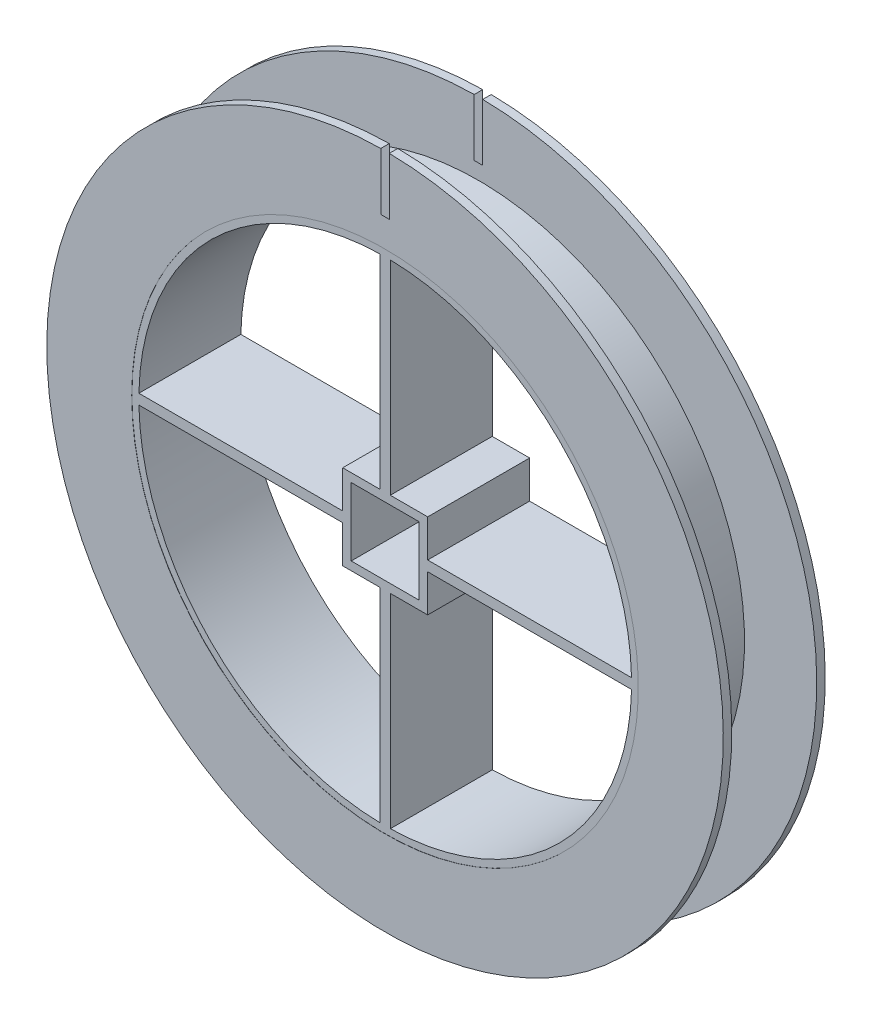
ISO-10303-21;
HEADER;
FILE_DESCRIPTION(('STEP AP214'),'2;1');
FILE_NAME('part.step','',(''),(''),'','','');
FILE_SCHEMA(('AUTOMOTIVE_DESIGN { 1 0 10303 214 1 1 1 1 }'));
ENDSEC;
DATA;
#1=APPLICATION_CONTEXT('core data for automotive mechanical design processes');
#2=APPLICATION_PROTOCOL_DEFINITION('international standard','automotive_design',2000,#1);
#3=PRODUCT_CONTEXT('',#1,'mechanical');
#4=PRODUCT('Part','Part','',(#3));
#5=PRODUCT_RELATED_PRODUCT_CATEGORY('part','',(#4));
#6=PRODUCT_DEFINITION_FORMATION('','',#4);
#7=PRODUCT_DEFINITION_CONTEXT('part definition',#1,'design');
#8=PRODUCT_DEFINITION('design','',#6,#7);
#9=PRODUCT_DEFINITION_SHAPE('','',#8);
#10=(LENGTH_UNIT() NAMED_UNIT(*) SI_UNIT(.MILLI.,.METRE.));
#11=(NAMED_UNIT(*) PLANE_ANGLE_UNIT() SI_UNIT($,.RADIAN.));
#12=(NAMED_UNIT(*) SI_UNIT($,.STERADIAN.) SOLID_ANGLE_UNIT());
#13=UNCERTAINTY_MEASURE_WITH_UNIT(LENGTH_MEASURE(1.E-05),#10,'distance_accuracy_value','');
#14=(GEOMETRIC_REPRESENTATION_CONTEXT(3) GLOBAL_UNCERTAINTY_ASSIGNED_CONTEXT((#13)) GLOBAL_UNIT_ASSIGNED_CONTEXT((#10,
#11,#12)) REPRESENTATION_CONTEXT('',''));
#15=CARTESIAN_POINT('',(0.,0.,0.));
#16=DIRECTION('',(0.,0.,1.));
#17=DIRECTION('',(1.,0.,0.));
#18=AXIS2_PLACEMENT_3D('',#15,#16,#17);
#19=CARTESIAN_POINT('',(0.,0.,6.));
#20=DIRECTION('',(0.,0.,-1.));
#21=DIRECTION('',(-1.,0.,0.));
#22=AXIS2_PLACEMENT_3D('',#19,#20,#21);
#23=CYLINDRICAL_SURFACE('',#22,30.);
#24=CARTESIAN_POINT('',(0.,0.,6.));
#25=DIRECTION('',(0.,0.,1.));
#26=DIRECTION('',(1.,0.,0.));
#27=AXIS2_PLACEMENT_3D('',#24,#25,#26);
#28=CIRCLE('',#27,30.);
#29=CARTESIAN_POINT('',(30.,0.,6.));
#30=VERTEX_POINT('',#29);
#31=EDGE_CURVE('E12',#30,#30,#28,.T.);
#32=ORIENTED_EDGE('',*,*,#31,.F.);
#33=EDGE_LOOP('',(#32));
#34=FACE_BOUND('',#33,.T.);
#35=CARTESIAN_POINT('',(0.,0.,-6.));
#36=DIRECTION('',(0.,0.,1.));
#37=DIRECTION('',(1.,0.,0.));
#38=AXIS2_PLACEMENT_3D('',#35,#36,#37);
#39=CIRCLE('',#38,30.);
#40=CARTESIAN_POINT('',(30.,0.,-6.));
#41=VERTEX_POINT('',#40);
#42=EDGE_CURVE('E59',#41,#41,#39,.T.);
#43=ORIENTED_EDGE('',*,*,#42,.T.);
#44=EDGE_LOOP('',(#43));
#45=FACE_BOUND('',#44,.T.);
#46=ADVANCED_FACE('F56',(#34,#45),#23,.T.);
#47=CARTESIAN_POINT('',(0.,0.,6.));
#48=DIRECTION('',(0.,0.,1.));
#49=DIRECTION('',(1.,0.,0.));
#50=AXIS2_PLACEMENT_3D('',#47,#48,#49);
#51=PLANE('',#50);
#52=CARTESIAN_POINT('',(0.,0.,6.));
#53=DIRECTION('',(0.,0.,1.));
#54=DIRECTION('',(1.,0.,0.));
#55=AXIS2_PLACEMENT_3D('',#52,#53,#54);
#56=CIRCLE('',#55,29.);
#57=CARTESIAN_POINT('',(0.600000000000004,-28.9937924390722,6.));
#58=VERTEX_POINT('',#57);
#59=CARTESIAN_POINT('',(28.9937924390722,-0.6,6.));
#60=VERTEX_POINT('',#59);
#61=EDGE_CURVE('E71',#58,#60,#56,.T.);
#62=ORIENTED_EDGE('',*,*,#61,.F.);
#63=DIRECTION('',(0.,-1.,0.));
#64=VECTOR('',#63,1.);
#65=CARTESIAN_POINT('',(0.600000000000004,-5.,6.));
#66=LINE('',#65,#64);
#67=CARTESIAN_POINT('',(0.600000000000004,-5.,6.));
#68=VERTEX_POINT('',#67);
#69=EDGE_CURVE('E398',#68,#58,#66,.T.);
#70=ORIENTED_EDGE('',*,*,#69,.F.);
#71=DIRECTION('',(-1.,0.,0.));
#72=VECTOR('',#71,1.);
#73=CARTESIAN_POINT('',(0.600000000000004,-5.,6.));
#74=LINE('',#73,#72);
#75=CARTESIAN_POINT('',(5.,-5.,6.));
#76=VERTEX_POINT('',#75);
#77=EDGE_CURVE('E402',#76,#68,#74,.T.);
#78=ORIENTED_EDGE('',*,*,#77,.F.);
#79=DIRECTION('',(0.,-1.,0.));
#80=VECTOR('',#79,1.);
#81=CARTESIAN_POINT('',(5.,-0.6,6.));
#82=LINE('',#81,#80);
#83=CARTESIAN_POINT('',(5.,-0.6,6.));
#84=VERTEX_POINT('',#83);
#85=EDGE_CURVE('E407',#84,#76,#82,.T.);
#86=ORIENTED_EDGE('',*,*,#85,.F.);
#87=DIRECTION('',(-1.,0.,0.));
#88=VECTOR('',#87,1.);
#89=CARTESIAN_POINT('',(5.,-0.6,6.));
#90=LINE('',#89,#88);
#91=EDGE_CURVE('E411',#60,#84,#90,.T.);
#92=ORIENTED_EDGE('',*,*,#91,.F.);
#93=EDGE_LOOP('',(#62,#70,#78,#86,#92));
#94=FACE_BOUND('',#93,.T.);
#95=CARTESIAN_POINT('',(0.,0.,6.));
#96=DIRECTION('',(0.,0.,1.));
#97=DIRECTION('',(1.,0.,0.));
#98=AXIS2_PLACEMENT_3D('',#95,#96,#97);
#99=CIRCLE('',#98,29.);
#100=CARTESIAN_POINT('',(-28.9937924390722,-0.6,6.));
#101=VERTEX_POINT('',#100);
#102=CARTESIAN_POINT('',(-0.599999999999996,-28.9937924390722,6.));
#103=VERTEX_POINT('',#102);
#104=EDGE_CURVE('E79',#101,#103,#99,.T.);
#105=ORIENTED_EDGE('',*,*,#104,.F.);
#106=DIRECTION('',(-1.,0.,0.));
#107=VECTOR('',#106,1.);
#108=CARTESIAN_POINT('',(-28.9937924390722,-0.6,6.));
#109=LINE('',#108,#107);
#110=CARTESIAN_POINT('',(-5.,-0.6,6.));
#111=VERTEX_POINT('',#110);
#112=EDGE_CURVE('E345',#111,#101,#109,.T.);
#113=ORIENTED_EDGE('',*,*,#112,.F.);
#114=DIRECTION('',(0.,1.,0.));
#115=VECTOR('',#114,1.);
#116=CARTESIAN_POINT('',(-5.,-0.6,6.));
#117=LINE('',#116,#115);
#118=CARTESIAN_POINT('',(-5.,-5.,6.));
#119=VERTEX_POINT('',#118);
#120=EDGE_CURVE('E349',#119,#111,#117,.T.);
#121=ORIENTED_EDGE('',*,*,#120,.F.);
#122=DIRECTION('',(-1.,0.,0.));
#123=VECTOR('',#122,1.);
#124=CARTESIAN_POINT('',(-5.,-5.,6.));
#125=LINE('',#124,#123);
#126=CARTESIAN_POINT('',(-0.599999999999996,-5.,6.));
#127=VERTEX_POINT('',#126);
#128=EDGE_CURVE('E354',#127,#119,#125,.T.);
#129=ORIENTED_EDGE('',*,*,#128,.F.);
#130=DIRECTION('',(0.,1.,0.));
#131=VECTOR('',#130,1.);
#132=CARTESIAN_POINT('',(-0.599999999999996,-5.,6.));
#133=LINE('',#132,#131);
#134=EDGE_CURVE('E358',#103,#127,#133,.T.);
#135=ORIENTED_EDGE('',*,*,#134,.F.);
#136=EDGE_LOOP('',(#105,#113,#121,#129,#135));
#137=FACE_BOUND('',#136,.T.);
#138=CARTESIAN_POINT('',(0.,0.,6.));
#139=DIRECTION('',(0.,0.,1.));
#140=DIRECTION('',(1.,0.,0.));
#141=AXIS2_PLACEMENT_3D('',#138,#139,#140);
#142=CIRCLE('',#141,29.);
#143=CARTESIAN_POINT('',(-0.599999999999996,28.9937924390722,6.));
#144=VERTEX_POINT('',#143);
#145=CARTESIAN_POINT('',(-28.9937924390722,0.6,6.));
#146=VERTEX_POINT('',#145);
#147=EDGE_CURVE('E229',#144,#146,#142,.T.);
#148=ORIENTED_EDGE('',*,*,#147,.F.);
#149=DIRECTION('',(0.,1.,0.));
#150=VECTOR('',#149,1.);
#151=CARTESIAN_POINT('',(-0.599999999999996,28.9937924390722,6.));
#152=LINE('',#151,#150);
#153=CARTESIAN_POINT('',(-0.599999999999996,5.,6.));
#154=VERTEX_POINT('',#153);
#155=EDGE_CURVE('E292',#154,#144,#152,.T.);
#156=ORIENTED_EDGE('',*,*,#155,.F.);
#157=DIRECTION('',(1.,0.,0.));
#158=VECTOR('',#157,1.);
#159=CARTESIAN_POINT('',(-5.,5.,6.));
#160=LINE('',#159,#158);
#161=CARTESIAN_POINT('',(-5.,5.,6.));
#162=VERTEX_POINT('',#161);
#163=EDGE_CURVE('E296',#162,#154,#160,.T.);
#164=ORIENTED_EDGE('',*,*,#163,.F.);
#165=DIRECTION('',(0.,1.,0.));
#166=VECTOR('',#165,1.);
#167=CARTESIAN_POINT('',(-5.,5.,6.));
#168=LINE('',#167,#166);
#169=CARTESIAN_POINT('',(-5.,0.6,6.));
#170=VERTEX_POINT('',#169);
#171=EDGE_CURVE('E301',#170,#162,#168,.T.);
#172=ORIENTED_EDGE('',*,*,#171,.F.);
#173=DIRECTION('',(1.,0.,0.));
#174=VECTOR('',#173,1.);
#175=CARTESIAN_POINT('',(-28.9937924390722,0.6,6.));
#176=LINE('',#175,#174);
#177=EDGE_CURVE('E305',#146,#170,#176,.T.);
#178=ORIENTED_EDGE('',*,*,#177,.F.);
#179=EDGE_LOOP('',(#148,#156,#164,#172,#178));
#180=FACE_BOUND('',#179,.T.);
#181=CARTESIAN_POINT('',(0.,0.,6.));
#182=DIRECTION('',(0.,0.,1.));
#183=DIRECTION('',(1.,0.,0.));
#184=AXIS2_PLACEMENT_3D('',#181,#182,#183);
#185=CIRCLE('',#184,29.);
#186=CARTESIAN_POINT('',(28.9937924390722,0.6,6.));
#187=VERTEX_POINT('',#186);
#188=CARTESIAN_POINT('',(0.600000000000004,28.9937924390722,6.));
#189=VERTEX_POINT('',#188);
#190=EDGE_CURVE('E220',#187,#189,#185,.T.);
#191=ORIENTED_EDGE('',*,*,#190,.F.);
#192=DIRECTION('',(1.,0.,0.));
#193=VECTOR('',#192,1.);
#194=CARTESIAN_POINT('',(5.,0.6,6.));
#195=LINE('',#194,#193);
#196=CARTESIAN_POINT('',(5.,0.6,6.));
#197=VERTEX_POINT('',#196);
#198=EDGE_CURVE('E232',#197,#187,#195,.T.);
#199=ORIENTED_EDGE('',*,*,#198,.F.);
#200=DIRECTION('',(0.,-1.,0.));
#201=VECTOR('',#200,1.);
#202=CARTESIAN_POINT('',(5.,5.,6.));
#203=LINE('',#202,#201);
#204=CARTESIAN_POINT('',(5.,5.,6.));
#205=VERTEX_POINT('',#204);
#206=EDGE_CURVE('E238',#205,#197,#203,.T.);
#207=ORIENTED_EDGE('',*,*,#206,.F.);
#208=DIRECTION('',(1.,0.,0.));
#209=VECTOR('',#208,1.);
#210=CARTESIAN_POINT('',(0.600000000000004,5.,6.));
#211=LINE('',#210,#209);
#212=CARTESIAN_POINT('',(0.600000000000004,5.,6.));
#213=VERTEX_POINT('',#212);
#214=EDGE_CURVE('E253',#213,#205,#211,.T.);
#215=ORIENTED_EDGE('',*,*,#214,.F.);
#216=DIRECTION('',(0.,-1.,0.));
#217=VECTOR('',#216,1.);
#218=CARTESIAN_POINT('',(0.600000000000004,28.9937924390722,6.));
#219=LINE('',#218,#217);
#220=EDGE_CURVE('E245',#189,#213,#219,.T.);
#221=ORIENTED_EDGE('',*,*,#220,.F.);
#222=EDGE_LOOP('',(#191,#199,#207,#215,#221));
#223=FACE_BOUND('',#222,.T.);
#224=DIRECTION('',(0.,1.,0.));
#225=VECTOR('',#224,1.);
#226=CARTESIAN_POINT('',(4.,4.,6.));
#227=LINE('',#226,#225);
#228=CARTESIAN_POINT('',(4.,-4.,6.));
#229=VERTEX_POINT('',#228);
#230=CARTESIAN_POINT('',(4.,4.,6.));
#231=VERTEX_POINT('',#230);
#232=EDGE_CURVE('E247',#229,#231,#227,.T.);
#233=ORIENTED_EDGE('',*,*,#232,.F.);
#234=DIRECTION('',(1.,0.,0.));
#235=VECTOR('',#234,1.);
#236=CARTESIAN_POINT('',(-4.,-4.,6.));
#237=LINE('',#236,#235);
#238=CARTESIAN_POINT('',(-4.,-4.,6.));
#239=VERTEX_POINT('',#238);
#240=EDGE_CURVE('E440',#239,#229,#237,.T.);
#241=ORIENTED_EDGE('',*,*,#240,.F.);
#242=DIRECTION('',(0.,-1.,0.));
#243=VECTOR('',#242,1.);
#244=CARTESIAN_POINT('',(-4.,4.,6.));
#245=LINE('',#244,#243);
#246=CARTESIAN_POINT('',(-4.,4.,6.));
#247=VERTEX_POINT('',#246);
#248=EDGE_CURVE('E456',#247,#239,#245,.T.);
#249=ORIENTED_EDGE('',*,*,#248,.F.);
#250=DIRECTION('',(-1.,0.,0.));
#251=VECTOR('',#250,1.);
#252=CARTESIAN_POINT('',(-4.,4.,6.));
#253=LINE('',#252,#251);
#254=EDGE_CURVE('E251',#231,#247,#253,.T.);
#255=ORIENTED_EDGE('',*,*,#254,.F.);
#256=EDGE_LOOP('',(#233,#241,#249,#255));
#257=FACE_BOUND('',#256,.T.);
#258=ORIENTED_EDGE('',*,*,#31,.T.);
#259=EDGE_LOOP('',(#258));
#260=FACE_BOUND('',#259,.T.);
#261=ADVANCED_FACE('F241',(#94,#137,#180,#223,#257,#260),#51,.T.);
#262=CARTESIAN_POINT('',(0.,0.,-6.));
#263=DIRECTION('',(0.,0.,1.));
#264=DIRECTION('',(1.,0.,0.));
#265=AXIS2_PLACEMENT_3D('',#262,#263,#264);
#266=PLANE('',#265);
#267=DIRECTION('',(0.,-1.,0.));
#268=VECTOR('',#267,1.);
#269=CARTESIAN_POINT('',(0.600000000000004,-5.,-6.));
#270=LINE('',#269,#268);
#271=CARTESIAN_POINT('',(0.600000000000004,-5.,-6.));
#272=VERTEX_POINT('',#271);
#273=CARTESIAN_POINT('',(0.600000000000004,-28.9937924390722,-6.));
#274=VERTEX_POINT('',#273);
#275=EDGE_CURVE('E385',#272,#274,#270,.T.);
#276=ORIENTED_EDGE('',*,*,#275,.T.);
#277=CARTESIAN_POINT('',(0.,0.,-6.));
#278=DIRECTION('',(0.,0.,1.));
#279=DIRECTION('',(1.,0.,0.));
#280=AXIS2_PLACEMENT_3D('',#277,#278,#279);
#281=CIRCLE('',#280,29.);
#282=CARTESIAN_POINT('',(28.9937924390722,-0.6,-6.));
#283=VERTEX_POINT('',#282);
#284=EDGE_CURVE('E403',#274,#283,#281,.T.);
#285=ORIENTED_EDGE('',*,*,#284,.T.);
#286=DIRECTION('',(-1.,0.,0.));
#287=VECTOR('',#286,1.);
#288=CARTESIAN_POINT('',(5.,-0.6,-6.));
#289=LINE('',#288,#287);
#290=CARTESIAN_POINT('',(5.,-0.6,-6.));
#291=VERTEX_POINT('',#290);
#292=EDGE_CURVE('E428',#283,#291,#289,.T.);
#293=ORIENTED_EDGE('',*,*,#292,.T.);
#294=DIRECTION('',(0.,-1.,0.));
#295=VECTOR('',#294,1.);
#296=CARTESIAN_POINT('',(5.,-0.6,-6.));
#297=LINE('',#296,#295);
#298=CARTESIAN_POINT('',(5.,-5.,-6.));
#299=VERTEX_POINT('',#298);
#300=EDGE_CURVE('E424',#291,#299,#297,.T.);
#301=ORIENTED_EDGE('',*,*,#300,.T.);
#302=DIRECTION('',(-1.,0.,0.));
#303=VECTOR('',#302,1.);
#304=CARTESIAN_POINT('',(0.600000000000004,-5.,-6.));
#305=LINE('',#304,#303);
#306=EDGE_CURVE('E420',#299,#272,#305,.T.);
#307=ORIENTED_EDGE('',*,*,#306,.T.);
#308=EDGE_LOOP('',(#276,#285,#293,#301,#307));
#309=FACE_BOUND('',#308,.T.);
#310=DIRECTION('',(-1.,0.,0.));
#311=VECTOR('',#310,1.);
#312=CARTESIAN_POINT('',(-28.9937924390722,-0.6,-6.));
#313=LINE('',#312,#311);
#314=CARTESIAN_POINT('',(-5.,-0.6,-6.));
#315=VERTEX_POINT('',#314);
#316=CARTESIAN_POINT('',(-28.9937924390722,-0.6,-6.));
#317=VERTEX_POINT('',#316);
#318=EDGE_CURVE('E332',#315,#317,#313,.T.);
#319=ORIENTED_EDGE('',*,*,#318,.T.);
#320=CARTESIAN_POINT('',(0.,0.,-6.));
#321=DIRECTION('',(0.,0.,1.));
#322=DIRECTION('',(1.,0.,0.));
#323=AXIS2_PLACEMENT_3D('',#320,#321,#322);
#324=CIRCLE('',#323,29.);
#325=CARTESIAN_POINT('',(-0.599999999999996,-28.9937924390722,-6.));
#326=VERTEX_POINT('',#325);
#327=EDGE_CURVE('E350',#317,#326,#324,.T.);
#328=ORIENTED_EDGE('',*,*,#327,.T.);
#329=DIRECTION('',(0.,1.,0.));
#330=VECTOR('',#329,1.);
#331=CARTESIAN_POINT('',(-0.599999999999996,-5.,-6.));
#332=LINE('',#331,#330);
#333=CARTESIAN_POINT('',(-0.599999999999996,-5.,-6.));
#334=VERTEX_POINT('',#333);
#335=EDGE_CURVE('E375',#326,#334,#332,.T.);
#336=ORIENTED_EDGE('',*,*,#335,.T.);
#337=DIRECTION('',(-1.,0.,0.));
#338=VECTOR('',#337,1.);
#339=CARTESIAN_POINT('',(-5.,-5.,-6.));
#340=LINE('',#339,#338);
#341=CARTESIAN_POINT('',(-5.,-5.,-6.));
#342=VERTEX_POINT('',#341);
#343=EDGE_CURVE('E371',#334,#342,#340,.T.);
#344=ORIENTED_EDGE('',*,*,#343,.T.);
#345=DIRECTION('',(0.,1.,0.));
#346=VECTOR('',#345,1.);
#347=CARTESIAN_POINT('',(-5.,-0.6,-6.));
#348=LINE('',#347,#346);
#349=EDGE_CURVE('E367',#342,#315,#348,.T.);
#350=ORIENTED_EDGE('',*,*,#349,.T.);
#351=EDGE_LOOP('',(#319,#328,#336,#344,#350));
#352=FACE_BOUND('',#351,.T.);
#353=DIRECTION('',(0.,1.,0.));
#354=VECTOR('',#353,1.);
#355=CARTESIAN_POINT('',(-0.599999999999996,28.9937924390722,-6.));
#356=LINE('',#355,#354);
#357=CARTESIAN_POINT('',(-0.599999999999996,5.,-6.));
#358=VERTEX_POINT('',#357);
#359=CARTESIAN_POINT('',(-0.599999999999996,28.9937924390722,-6.));
#360=VERTEX_POINT('',#359);
#361=EDGE_CURVE('E279',#358,#360,#356,.T.);
#362=ORIENTED_EDGE('',*,*,#361,.T.);
#363=CARTESIAN_POINT('',(0.,0.,-6.));
#364=DIRECTION('',(0.,0.,1.));
#365=DIRECTION('',(1.,0.,0.));
#366=AXIS2_PLACEMENT_3D('',#363,#364,#365);
#367=CIRCLE('',#366,29.);
#368=CARTESIAN_POINT('',(-28.9937924390722,0.6,-6.));
#369=VERTEX_POINT('',#368);
#370=EDGE_CURVE('E297',#360,#369,#367,.T.);
#371=ORIENTED_EDGE('',*,*,#370,.T.);
#372=DIRECTION('',(1.,0.,0.));
#373=VECTOR('',#372,1.);
#374=CARTESIAN_POINT('',(-28.9937924390722,0.6,-6.));
#375=LINE('',#374,#373);
#376=CARTESIAN_POINT('',(-5.,0.6,-6.));
#377=VERTEX_POINT('',#376);
#378=EDGE_CURVE('E322',#369,#377,#375,.T.);
#379=ORIENTED_EDGE('',*,*,#378,.T.);
#380=DIRECTION('',(0.,1.,0.));
#381=VECTOR('',#380,1.);
#382=CARTESIAN_POINT('',(-5.,5.,-6.));
#383=LINE('',#382,#381);
#384=CARTESIAN_POINT('',(-5.,5.,-6.));
#385=VERTEX_POINT('',#384);
#386=EDGE_CURVE('E318',#377,#385,#383,.T.);
#387=ORIENTED_EDGE('',*,*,#386,.T.);
#388=DIRECTION('',(1.,0.,0.));
#389=VECTOR('',#388,1.);
#390=CARTESIAN_POINT('',(-5.,5.,-6.));
#391=LINE('',#390,#389);
#392=EDGE_CURVE('E314',#385,#358,#391,.T.);
#393=ORIENTED_EDGE('',*,*,#392,.T.);
#394=EDGE_LOOP('',(#362,#371,#379,#387,#393));
#395=FACE_BOUND('',#394,.T.);
#396=DIRECTION('',(1.,0.,0.));
#397=VECTOR('',#396,1.);
#398=CARTESIAN_POINT('',(5.,0.6,-6.));
#399=LINE('',#398,#397);
#400=CARTESIAN_POINT('',(5.,0.6,-6.));
#401=VERTEX_POINT('',#400);
#402=CARTESIAN_POINT('',(28.9937924390722,0.6,-6.));
#403=VERTEX_POINT('',#402);
#404=EDGE_CURVE('E257',#401,#403,#399,.T.);
#405=ORIENTED_EDGE('',*,*,#404,.T.);
#406=CARTESIAN_POINT('',(0.,0.,-6.));
#407=DIRECTION('',(0.,0.,1.));
#408=DIRECTION('',(1.,0.,0.));
#409=AXIS2_PLACEMENT_3D('',#406,#407,#408);
#410=CIRCLE('',#409,29.);
#411=CARTESIAN_POINT('',(0.600000000000004,28.9937924390722,-6.));
#412=VERTEX_POINT('',#411);
#413=EDGE_CURVE('E223',#403,#412,#410,.T.);
#414=ORIENTED_EDGE('',*,*,#413,.T.);
#415=DIRECTION('',(0.,-1.,0.));
#416=VECTOR('',#415,1.);
#417=CARTESIAN_POINT('',(0.600000000000004,28.9937924390722,-6.));
#418=LINE('',#417,#416);
#419=CARTESIAN_POINT('',(0.600000000000004,5.,-6.));
#420=VERTEX_POINT('',#419);
#421=EDGE_CURVE('E269',#412,#420,#418,.T.);
#422=ORIENTED_EDGE('',*,*,#421,.T.);
#423=DIRECTION('',(1.,0.,0.));
#424=VECTOR('',#423,1.);
#425=CARTESIAN_POINT('',(0.600000000000004,5.,-6.));
#426=LINE('',#425,#424);
#427=CARTESIAN_POINT('',(5.,5.,-6.));
#428=VERTEX_POINT('',#427);
#429=EDGE_CURVE('E265',#420,#428,#426,.T.);
#430=ORIENTED_EDGE('',*,*,#429,.T.);
#431=DIRECTION('',(0.,-1.,0.));
#432=VECTOR('',#431,1.);
#433=CARTESIAN_POINT('',(5.,5.,-6.));
#434=LINE('',#433,#432);
#435=EDGE_CURVE('E260',#428,#401,#434,.T.);
#436=ORIENTED_EDGE('',*,*,#435,.T.);
#437=EDGE_LOOP('',(#405,#414,#422,#430,#436));
#438=FACE_BOUND('',#437,.T.);
#439=DIRECTION('',(1.,0.,0.));
#440=VECTOR('',#439,1.);
#441=CARTESIAN_POINT('',(-4.,-4.,-6.));
#442=LINE('',#441,#440);
#443=CARTESIAN_POINT('',(-4.,-4.,-6.));
#444=VERTEX_POINT('',#443);
#445=CARTESIAN_POINT('',(4.,-4.,-6.));
#446=VERTEX_POINT('',#445);
#447=EDGE_CURVE('E448',#444,#446,#442,.T.);
#448=ORIENTED_EDGE('',*,*,#447,.T.);
#449=DIRECTION('',(0.,1.,0.));
#450=VECTOR('',#449,1.);
#451=CARTESIAN_POINT('',(4.,4.,-6.));
#452=LINE('',#451,#450);
#453=CARTESIAN_POINT('',(4.,4.,-6.));
#454=VERTEX_POINT('',#453);
#455=EDGE_CURVE('E435',#446,#454,#452,.T.);
#456=ORIENTED_EDGE('',*,*,#455,.T.);
#457=DIRECTION('',(-1.,0.,0.));
#458=VECTOR('',#457,1.);
#459=CARTESIAN_POINT('',(-4.,4.,-6.));
#460=LINE('',#459,#458);
#461=CARTESIAN_POINT('',(-4.,4.,-6.));
#462=VERTEX_POINT('',#461);
#463=EDGE_CURVE('E439',#454,#462,#460,.T.);
#464=ORIENTED_EDGE('',*,*,#463,.T.);
#465=DIRECTION('',(0.,-1.,0.));
#466=VECTOR('',#465,1.);
#467=CARTESIAN_POINT('',(-4.,4.,-6.));
#468=LINE('',#467,#466);
#469=EDGE_CURVE('E444',#462,#444,#468,.T.);
#470=ORIENTED_EDGE('',*,*,#469,.T.);
#471=EDGE_LOOP('',(#448,#456,#464,#470));
#472=FACE_BOUND('',#471,.T.);
#473=ORIENTED_EDGE('',*,*,#42,.F.);
#474=EDGE_LOOP('',(#473));
#475=FACE_BOUND('',#474,.T.);
#476=ADVANCED_FACE('F489',(#309,#352,#395,#438,#472,#475),#266,.F.);
#477=CARTESIAN_POINT('',(4.,4.,-6.));
#478=DIRECTION('',(1.,0.,0.));
#479=DIRECTION('',(0.,1.,0.));
#480=AXIS2_PLACEMENT_3D('',#477,#478,#479);
#481=PLANE('',#480);
#482=ORIENTED_EDGE('',*,*,#232,.T.);
#483=DIRECTION('',(0.,0.,1.));
#484=VECTOR('',#483,1.);
#485=CARTESIAN_POINT('',(4.,4.,-6.));
#486=LINE('',#485,#484);
#487=EDGE_CURVE('E451',#454,#231,#486,.T.);
#488=ORIENTED_EDGE('',*,*,#487,.F.);
#489=ORIENTED_EDGE('',*,*,#455,.F.);
#490=DIRECTION('',(0.,0.,1.));
#491=VECTOR('',#490,1.);
#492=CARTESIAN_POINT('',(4.,-4.,-6.));
#493=LINE('',#492,#491);
#494=EDGE_CURVE('E463',#446,#229,#493,.T.);
#495=ORIENTED_EDGE('',*,*,#494,.T.);
#496=EDGE_LOOP('',(#482,#488,#489,#495));
#497=FACE_BOUND('',#496,.T.);
#498=ADVANCED_FACE('F491',(#497),#481,.F.);
#499=CARTESIAN_POINT('',(-4.,-4.,-6.));
#500=DIRECTION('',(0.,-1.,0.));
#501=DIRECTION('',(0.,0.,-1.));
#502=AXIS2_PLACEMENT_3D('',#499,#500,#501);
#503=PLANE('',#502);
#504=ORIENTED_EDGE('',*,*,#240,.T.);
#505=ORIENTED_EDGE('',*,*,#494,.F.);
#506=ORIENTED_EDGE('',*,*,#447,.F.);
#507=DIRECTION('',(0.,0.,1.));
#508=VECTOR('',#507,1.);
#509=CARTESIAN_POINT('',(-4.,-4.,-6.));
#510=LINE('',#509,#508);
#511=EDGE_CURVE('E466',#444,#239,#510,.T.);
#512=ORIENTED_EDGE('',*,*,#511,.T.);
#513=EDGE_LOOP('',(#504,#505,#506,#512));
#514=FACE_BOUND('',#513,.T.);
#515=ADVANCED_FACE('F493',(#514),#503,.F.);
#516=CARTESIAN_POINT('',(-4.,4.,-6.));
#517=DIRECTION('',(-1.,0.,0.));
#518=DIRECTION('',(0.,-1.,0.));
#519=AXIS2_PLACEMENT_3D('',#516,#517,#518);
#520=PLANE('',#519);
#521=ORIENTED_EDGE('',*,*,#248,.T.);
#522=ORIENTED_EDGE('',*,*,#511,.F.);
#523=ORIENTED_EDGE('',*,*,#469,.F.);
#524=DIRECTION('',(0.,0.,1.));
#525=VECTOR('',#524,1.);
#526=CARTESIAN_POINT('',(-4.,4.,-6.));
#527=LINE('',#526,#525);
#528=EDGE_CURVE('E469',#462,#247,#527,.T.);
#529=ORIENTED_EDGE('',*,*,#528,.T.);
#530=EDGE_LOOP('',(#521,#522,#523,#529));
#531=FACE_BOUND('',#530,.T.);
#532=ADVANCED_FACE('F486',(#531),#520,.F.);
#533=CARTESIAN_POINT('',(-4.,4.,-6.));
#534=DIRECTION('',(0.,1.,0.));
#535=DIRECTION('',(0.,0.,1.));
#536=AXIS2_PLACEMENT_3D('',#533,#534,#535);
#537=PLANE('',#536);
#538=ORIENTED_EDGE('',*,*,#254,.T.);
#539=ORIENTED_EDGE('',*,*,#528,.F.);
#540=ORIENTED_EDGE('',*,*,#463,.F.);
#541=ORIENTED_EDGE('',*,*,#487,.T.);
#542=EDGE_LOOP('',(#538,#539,#540,#541));
#543=FACE_BOUND('',#542,.T.);
#544=ADVANCED_FACE('F477',(#543),#537,.F.);
#545=CARTESIAN_POINT('',(0.,0.,-6.));
#546=DIRECTION('',(0.,0.,1.));
#547=DIRECTION('',(1.,0.,0.));
#548=AXIS2_PLACEMENT_3D('',#545,#546,#547);
#549=CYLINDRICAL_SURFACE('',#548,29.);
#550=ORIENTED_EDGE('',*,*,#190,.T.);
#551=DIRECTION('',(0.,0.,1.));
#552=VECTOR('',#551,1.);
#553=CARTESIAN_POINT('',(0.600000000000004,28.9937924390722,-6.));
#554=LINE('',#553,#552);
#555=EDGE_CURVE('E261',#412,#189,#554,.T.);
#556=ORIENTED_EDGE('',*,*,#555,.F.);
#557=ORIENTED_EDGE('',*,*,#413,.F.);
#558=DIRECTION('',(0.,0.,1.));
#559=VECTOR('',#558,1.);
#560=CARTESIAN_POINT('',(28.9937924390722,0.6,-6.));
#561=LINE('',#560,#559);
#562=EDGE_CURVE('E216',#403,#187,#561,.T.);
#563=ORIENTED_EDGE('',*,*,#562,.T.);
#564=EDGE_LOOP('',(#550,#556,#557,#563));
#565=FACE_BOUND('',#564,.T.);
#566=ADVANCED_FACE('F218',(#565),#549,.F.);
#567=CARTESIAN_POINT('',(5.,0.6,-6.));
#568=DIRECTION('',(0.,-1.,0.));
#569=DIRECTION('',(0.,0.,-1.));
#570=AXIS2_PLACEMENT_3D('',#567,#568,#569);
#571=PLANE('',#570);
#572=ORIENTED_EDGE('',*,*,#198,.T.);
#573=ORIENTED_EDGE('',*,*,#562,.F.);
#574=ORIENTED_EDGE('',*,*,#404,.F.);
#575=DIRECTION('',(0.,0.,1.));
#576=VECTOR('',#575,1.);
#577=CARTESIAN_POINT('',(5.,0.6,-6.));
#578=LINE('',#577,#576);
#579=EDGE_CURVE('E228',#401,#197,#578,.T.);
#580=ORIENTED_EDGE('',*,*,#579,.T.);
#581=EDGE_LOOP('',(#572,#573,#574,#580));
#582=FACE_BOUND('',#581,.T.);
#583=ADVANCED_FACE('F233',(#582),#571,.F.);
#584=CARTESIAN_POINT('',(5.,5.,-6.));
#585=DIRECTION('',(-1.,0.,0.));
#586=DIRECTION('',(0.,0.,1.));
#587=AXIS2_PLACEMENT_3D('',#584,#585,#586);
#588=PLANE('',#587);
#589=ORIENTED_EDGE('',*,*,#206,.T.);
#590=ORIENTED_EDGE('',*,*,#579,.F.);
#591=ORIENTED_EDGE('',*,*,#435,.F.);
#592=DIRECTION('',(0.,0.,1.));
#593=VECTOR('',#592,1.);
#594=CARTESIAN_POINT('',(5.,5.,-6.));
#595=LINE('',#594,#593);
#596=EDGE_CURVE('E627',#428,#205,#595,.T.);
#597=ORIENTED_EDGE('',*,*,#596,.T.);
#598=EDGE_LOOP('',(#589,#590,#591,#597));
#599=FACE_BOUND('',#598,.T.);
#600=ADVANCED_FACE('F529',(#599),#588,.F.);
#601=CARTESIAN_POINT('',(0.600000000000004,5.,-6.));
#602=DIRECTION('',(0.,-1.,0.));
#603=DIRECTION('',(0.,0.,-1.));
#604=AXIS2_PLACEMENT_3D('',#601,#602,#603);
#605=PLANE('',#604);
#606=ORIENTED_EDGE('',*,*,#214,.T.);
#607=ORIENTED_EDGE('',*,*,#596,.F.);
#608=ORIENTED_EDGE('',*,*,#429,.F.);
#609=DIRECTION('',(0.,0.,1.));
#610=VECTOR('',#609,1.);
#611=CARTESIAN_POINT('',(0.600000000000004,5.,-6.));
#612=LINE('',#611,#610);
#613=EDGE_CURVE('E632',#420,#213,#612,.T.);
#614=ORIENTED_EDGE('',*,*,#613,.T.);
#615=EDGE_LOOP('',(#606,#607,#608,#614));
#616=FACE_BOUND('',#615,.T.);
#617=ADVANCED_FACE('F536',(#616),#605,.F.);
#618=CARTESIAN_POINT('',(0.600000000000004,28.9937924390722,-6.));
#619=DIRECTION('',(-1.,0.,0.));
#620=DIRECTION('',(0.,-1.,0.));
#621=AXIS2_PLACEMENT_3D('',#618,#619,#620);
#622=PLANE('',#621);
#623=ORIENTED_EDGE('',*,*,#220,.T.);
#624=ORIENTED_EDGE('',*,*,#613,.F.);
#625=ORIENTED_EDGE('',*,*,#421,.F.);
#626=ORIENTED_EDGE('',*,*,#555,.T.);
#627=EDGE_LOOP('',(#623,#624,#625,#626));
#628=FACE_BOUND('',#627,.T.);
#629=ADVANCED_FACE('F532',(#628),#622,.F.);
#630=CARTESIAN_POINT('',(0.,0.,-6.));
#631=DIRECTION('',(0.,0.,1.));
#632=DIRECTION('',(1.,0.,0.));
#633=AXIS2_PLACEMENT_3D('',#630,#631,#632);
#634=CYLINDRICAL_SURFACE('',#633,29.);
#635=ORIENTED_EDGE('',*,*,#147,.T.);
#636=DIRECTION('',(0.,0.,1.));
#637=VECTOR('',#636,1.);
#638=CARTESIAN_POINT('',(-28.9937924390722,0.6,-6.));
#639=LINE('',#638,#637);
#640=EDGE_CURVE('E275',#369,#146,#639,.T.);
#641=ORIENTED_EDGE('',*,*,#640,.F.);
#642=ORIENTED_EDGE('',*,*,#370,.F.);
#643=DIRECTION('',(0.,0.,1.));
#644=VECTOR('',#643,1.);
#645=CARTESIAN_POINT('',(-0.599999999999996,28.9937924390722,-6.));
#646=LINE('',#645,#644);
#647=EDGE_CURVE('E289',#360,#144,#646,.T.);
#648=ORIENTED_EDGE('',*,*,#647,.T.);
#649=EDGE_LOOP('',(#635,#641,#642,#648));
#650=FACE_BOUND('',#649,.T.);
#651=ADVANCED_FACE('F535',(#650),#634,.F.);
#652=CARTESIAN_POINT('',(-0.599999999999996,28.9937924390722,-6.));
#653=DIRECTION('',(1.,0.,0.));
#654=DIRECTION('',(0.,1.,0.));
#655=AXIS2_PLACEMENT_3D('',#652,#653,#654);
#656=PLANE('',#655);
#657=ORIENTED_EDGE('',*,*,#155,.T.);
#658=ORIENTED_EDGE('',*,*,#647,.F.);
#659=ORIENTED_EDGE('',*,*,#361,.F.);
#660=DIRECTION('',(0.,0.,1.));
#661=VECTOR('',#660,1.);
#662=CARTESIAN_POINT('',(-0.599999999999996,5.,-6.));
#663=LINE('',#662,#661);
#664=EDGE_CURVE('E286',#358,#154,#663,.T.);
#665=ORIENTED_EDGE('',*,*,#664,.T.);
#666=EDGE_LOOP('',(#657,#658,#659,#665));
#667=FACE_BOUND('',#666,.T.);
#668=ADVANCED_FACE('F546',(#667),#656,.F.);
#669=CARTESIAN_POINT('',(-5.,5.,-6.));
#670=DIRECTION('',(0.,-1.,0.));
#671=DIRECTION('',(0.,0.,-1.));
#672=AXIS2_PLACEMENT_3D('',#669,#670,#671);
#673=PLANE('',#672);
#674=ORIENTED_EDGE('',*,*,#163,.T.);
#675=ORIENTED_EDGE('',*,*,#664,.F.);
#676=ORIENTED_EDGE('',*,*,#392,.F.);
#677=DIRECTION('',(0.,0.,1.));
#678=VECTOR('',#677,1.);
#679=CARTESIAN_POINT('',(-5.,5.,-6.));
#680=LINE('',#679,#678);
#681=EDGE_CURVE('E283',#385,#162,#680,.T.);
#682=ORIENTED_EDGE('',*,*,#681,.T.);
#683=EDGE_LOOP('',(#674,#675,#676,#682));
#684=FACE_BOUND('',#683,.T.);
#685=ADVANCED_FACE('F556',(#684),#673,.F.);
#686=CARTESIAN_POINT('',(-5.,5.,-6.));
#687=DIRECTION('',(1.,0.,0.));
#688=DIRECTION('',(0.,1.,0.));
#689=AXIS2_PLACEMENT_3D('',#686,#687,#688);
#690=PLANE('',#689);
#691=ORIENTED_EDGE('',*,*,#171,.T.);
#692=ORIENTED_EDGE('',*,*,#681,.F.);
#693=ORIENTED_EDGE('',*,*,#386,.F.);
#694=DIRECTION('',(0.,0.,1.));
#695=VECTOR('',#694,1.);
#696=CARTESIAN_POINT('',(-5.,0.6,-6.));
#697=LINE('',#696,#695);
#698=EDGE_CURVE('E280',#377,#170,#697,.T.);
#699=ORIENTED_EDGE('',*,*,#698,.T.);
#700=EDGE_LOOP('',(#691,#692,#693,#699));
#701=FACE_BOUND('',#700,.T.);
#702=ADVANCED_FACE('F552',(#701),#690,.F.);
#703=CARTESIAN_POINT('',(-28.9937924390722,0.6,-6.));
#704=DIRECTION('',(0.,-1.,0.));
#705=DIRECTION('',(0.,0.,-1.));
#706=AXIS2_PLACEMENT_3D('',#703,#704,#705);
#707=PLANE('',#706);
#708=ORIENTED_EDGE('',*,*,#177,.T.);
#709=ORIENTED_EDGE('',*,*,#698,.F.);
#710=ORIENTED_EDGE('',*,*,#378,.F.);
#711=ORIENTED_EDGE('',*,*,#640,.T.);
#712=EDGE_LOOP('',(#708,#709,#710,#711));
#713=FACE_BOUND('',#712,.T.);
#714=ADVANCED_FACE('F548',(#713),#707,.F.);
#715=CARTESIAN_POINT('',(0.,0.,-6.));
#716=DIRECTION('',(0.,0.,1.));
#717=DIRECTION('',(1.,0.,0.));
#718=AXIS2_PLACEMENT_3D('',#715,#716,#717);
#719=CYLINDRICAL_SURFACE('',#718,29.);
#720=ORIENTED_EDGE('',*,*,#104,.T.);
#721=DIRECTION('',(0.,0.,1.));
#722=VECTOR('',#721,1.);
#723=CARTESIAN_POINT('',(-0.599999999999996,-28.9937924390722,-6.));
#724=LINE('',#723,#722);
#725=EDGE_CURVE('E329',#326,#103,#724,.T.);
#726=ORIENTED_EDGE('',*,*,#725,.F.);
#727=ORIENTED_EDGE('',*,*,#327,.F.);
#728=DIRECTION('',(0.,0.,1.));
#729=VECTOR('',#728,1.);
#730=CARTESIAN_POINT('',(-28.9937924390722,-0.6,-6.));
#731=LINE('',#730,#729);
#732=EDGE_CURVE('E342',#317,#101,#731,.T.);
#733=ORIENTED_EDGE('',*,*,#732,.T.);
#734=EDGE_LOOP('',(#720,#726,#727,#733));
#735=FACE_BOUND('',#734,.T.);
#736=ADVANCED_FACE('F551',(#735),#719,.F.);
#737=CARTESIAN_POINT('',(-28.9937924390722,-0.6,-6.));
#738=DIRECTION('',(0.,1.,0.));
#739=DIRECTION('',(0.,0.,1.));
#740=AXIS2_PLACEMENT_3D('',#737,#738,#739);
#741=PLANE('',#740);
#742=ORIENTED_EDGE('',*,*,#112,.T.);
#743=ORIENTED_EDGE('',*,*,#732,.F.);
#744=ORIENTED_EDGE('',*,*,#318,.F.);
#745=DIRECTION('',(0.,0.,1.));
#746=VECTOR('',#745,1.);
#747=CARTESIAN_POINT('',(-5.,-0.6,-6.));
#748=LINE('',#747,#746);
#749=EDGE_CURVE('E339',#315,#111,#748,.T.);
#750=ORIENTED_EDGE('',*,*,#749,.T.);
#751=EDGE_LOOP('',(#742,#743,#744,#750));
#752=FACE_BOUND('',#751,.T.);
#753=ADVANCED_FACE('F566',(#752),#741,.F.);
#754=CARTESIAN_POINT('',(-5.,-0.6,-6.));
#755=DIRECTION('',(1.,0.,0.));
#756=DIRECTION('',(0.,1.,0.));
#757=AXIS2_PLACEMENT_3D('',#754,#755,#756);
#758=PLANE('',#757);
#759=ORIENTED_EDGE('',*,*,#120,.T.);
#760=ORIENTED_EDGE('',*,*,#749,.F.);
#761=ORIENTED_EDGE('',*,*,#349,.F.);
#762=DIRECTION('',(0.,0.,1.));
#763=VECTOR('',#762,1.);
#764=CARTESIAN_POINT('',(-5.,-5.,-6.));
#765=LINE('',#764,#763);
#766=EDGE_CURVE('E336',#342,#119,#765,.T.);
#767=ORIENTED_EDGE('',*,*,#766,.T.);
#768=EDGE_LOOP('',(#759,#760,#761,#767));
#769=FACE_BOUND('',#768,.T.);
#770=ADVANCED_FACE('F575',(#769),#758,.F.);
#771=CARTESIAN_POINT('',(-5.,-5.,-6.));
#772=DIRECTION('',(0.,1.,0.));
#773=DIRECTION('',(0.,0.,1.));
#774=AXIS2_PLACEMENT_3D('',#771,#772,#773);
#775=PLANE('',#774);
#776=ORIENTED_EDGE('',*,*,#128,.T.);
#777=ORIENTED_EDGE('',*,*,#766,.F.);
#778=ORIENTED_EDGE('',*,*,#343,.F.);
#779=DIRECTION('',(0.,0.,1.));
#780=VECTOR('',#779,1.);
#781=CARTESIAN_POINT('',(-0.599999999999996,-5.,-6.));
#782=LINE('',#781,#780);
#783=EDGE_CURVE('E333',#334,#127,#782,.T.);
#784=ORIENTED_EDGE('',*,*,#783,.T.);
#785=EDGE_LOOP('',(#776,#777,#778,#784));
#786=FACE_BOUND('',#785,.T.);
#787=ADVANCED_FACE('F571',(#786),#775,.F.);
#788=CARTESIAN_POINT('',(-0.599999999999996,-5.,-6.));
#789=DIRECTION('',(1.,0.,0.));
#790=DIRECTION('',(0.,1.,0.));
#791=AXIS2_PLACEMENT_3D('',#788,#789,#790);
#792=PLANE('',#791);
#793=ORIENTED_EDGE('',*,*,#134,.T.);
#794=ORIENTED_EDGE('',*,*,#783,.F.);
#795=ORIENTED_EDGE('',*,*,#335,.F.);
#796=ORIENTED_EDGE('',*,*,#725,.T.);
#797=EDGE_LOOP('',(#793,#794,#795,#796));
#798=FACE_BOUND('',#797,.T.);
#799=ADVANCED_FACE('F567',(#798),#792,.F.);
#800=CARTESIAN_POINT('',(0.,0.,-6.));
#801=DIRECTION('',(0.,0.,1.));
#802=DIRECTION('',(1.,0.,0.));
#803=AXIS2_PLACEMENT_3D('',#800,#801,#802);
#804=CYLINDRICAL_SURFACE('',#803,29.);
#805=ORIENTED_EDGE('',*,*,#61,.T.);
#806=DIRECTION('',(0.,0.,1.));
#807=VECTOR('',#806,1.);
#808=CARTESIAN_POINT('',(28.9937924390722,-0.6,-6.));
#809=LINE('',#808,#807);
#810=EDGE_CURVE('E382',#283,#60,#809,.T.);
#811=ORIENTED_EDGE('',*,*,#810,.F.);
#812=ORIENTED_EDGE('',*,*,#284,.F.);
#813=DIRECTION('',(0.,0.,1.));
#814=VECTOR('',#813,1.);
#815=CARTESIAN_POINT('',(0.600000000000004,-28.9937924390722,-6.));
#816=LINE('',#815,#814);
#817=EDGE_CURVE('E395',#274,#58,#816,.T.);
#818=ORIENTED_EDGE('',*,*,#817,.T.);
#819=EDGE_LOOP('',(#805,#811,#812,#818));
#820=FACE_BOUND('',#819,.T.);
#821=ADVANCED_FACE('F570',(#820),#804,.F.);
#822=CARTESIAN_POINT('',(0.600000000000004,-5.,-6.));
#823=DIRECTION('',(-1.,0.,0.));
#824=DIRECTION('',(0.,-1.,0.));
#825=AXIS2_PLACEMENT_3D('',#822,#823,#824);
#826=PLANE('',#825);
#827=ORIENTED_EDGE('',*,*,#69,.T.);
#828=ORIENTED_EDGE('',*,*,#817,.F.);
#829=ORIENTED_EDGE('',*,*,#275,.F.);
#830=DIRECTION('',(0.,0.,1.));
#831=VECTOR('',#830,1.);
#832=CARTESIAN_POINT('',(0.600000000000004,-5.,-6.));
#833=LINE('',#832,#831);
#834=EDGE_CURVE('E392',#272,#68,#833,.T.);
#835=ORIENTED_EDGE('',*,*,#834,.T.);
#836=EDGE_LOOP('',(#827,#828,#829,#835));
#837=FACE_BOUND('',#836,.T.);
#838=ADVANCED_FACE('F585',(#837),#826,.F.);
#839=CARTESIAN_POINT('',(0.600000000000004,-5.,-6.));
#840=DIRECTION('',(0.,1.,0.));
#841=DIRECTION('',(0.,0.,1.));
#842=AXIS2_PLACEMENT_3D('',#839,#840,#841);
#843=PLANE('',#842);
#844=ORIENTED_EDGE('',*,*,#77,.T.);
#845=ORIENTED_EDGE('',*,*,#834,.F.);
#846=ORIENTED_EDGE('',*,*,#306,.F.);
#847=DIRECTION('',(0.,0.,1.));
#848=VECTOR('',#847,1.);
#849=CARTESIAN_POINT('',(5.,-5.,-6.));
#850=LINE('',#849,#848);
#851=EDGE_CURVE('E389',#299,#76,#850,.T.);
#852=ORIENTED_EDGE('',*,*,#851,.T.);
#853=EDGE_LOOP('',(#844,#845,#846,#852));
#854=FACE_BOUND('',#853,.T.);
#855=ADVANCED_FACE('F593',(#854),#843,.F.);
#856=CARTESIAN_POINT('',(5.,-0.6,-6.));
#857=DIRECTION('',(-1.,0.,0.));
#858=DIRECTION('',(0.,0.,1.));
#859=AXIS2_PLACEMENT_3D('',#856,#857,#858);
#860=PLANE('',#859);
#861=ORIENTED_EDGE('',*,*,#85,.T.);
#862=ORIENTED_EDGE('',*,*,#851,.F.);
#863=ORIENTED_EDGE('',*,*,#300,.F.);
#864=DIRECTION('',(0.,0.,1.));
#865=VECTOR('',#864,1.);
#866=CARTESIAN_POINT('',(5.,-0.6,-6.));
#867=LINE('',#866,#865);
#868=EDGE_CURVE('E386',#291,#84,#867,.T.);
#869=ORIENTED_EDGE('',*,*,#868,.T.);
#870=EDGE_LOOP('',(#861,#862,#863,#869));
#871=FACE_BOUND('',#870,.T.);
#872=ADVANCED_FACE('F589',(#871),#860,.F.);
#873=CARTESIAN_POINT('',(5.,-0.6,-6.));
#874=DIRECTION('',(0.,1.,0.));
#875=DIRECTION('',(0.,0.,1.));
#876=AXIS2_PLACEMENT_3D('',#873,#874,#875);
#877=PLANE('',#876);
#878=ORIENTED_EDGE('',*,*,#91,.T.);
#879=ORIENTED_EDGE('',*,*,#868,.F.);
#880=ORIENTED_EDGE('',*,*,#292,.F.);
#881=ORIENTED_EDGE('',*,*,#810,.T.);
#882=EDGE_LOOP('',(#878,#879,#880,#881));
#883=FACE_BOUND('',#882,.T.);
#884=ADVANCED_FACE('F586',(#883),#877,.F.);
#885=CLOSED_SHELL('',(#46,#261,#476,#498,#515,#532,#544,#566,#583,#600,#617,#629,#651,#668,#685,
#702,#714,#736,#753,#770,#787,#799,#821,#838,#855,#872,#884));
#886=MANIFOLD_SOLID_BREP('B2',#885);
#887=CARTESIAN_POINT('',(0.,0.,13.1815006050409));
#888=DIRECTION('',(0.,0.,-1.));
#889=DIRECTION('',(-1.,0.,0.));
#890=AXIS2_PLACEMENT_3D('',#887,#888,#889);
#891=CYLINDRICAL_SURFACE('',#890,39.8147761763901);
#892=DIRECTION('',(0.,0.,-1.));
#893=VECTOR('',#892,1.);
#894=CARTESIAN_POINT('',(-0.5,39.8116365146679,13.1815006050409));
#895=LINE('',#894,#893);
#896=CARTESIAN_POINT('',(-0.5,39.8116365146679,5.02145753405189));
#897=VERTEX_POINT('',#896);
#898=CARTESIAN_POINT('',(-0.5,39.8116365146679,6.02145753405189));
#899=VERTEX_POINT('',#898);
#900=EDGE_CURVE('E971',#897,#899,#895,.F.);
#901=ORIENTED_EDGE('',*,*,#900,.F.);
#902=CARTESIAN_POINT('',(0.,0.,5.02145753405189));
#903=DIRECTION('',(0.,0.,-1.));
#904=DIRECTION('',(-1.,0.,0.));
#905=AXIS2_PLACEMENT_3D('',#902,#903,#904);
#906=CIRCLE('',#905,39.8147761763901);
#907=CARTESIAN_POINT('',(0.5,39.8116365146679,5.02145753405189));
#908=VERTEX_POINT('',#907);
#909=EDGE_CURVE('E928',#908,#897,#906,.T.);
#910=ORIENTED_EDGE('',*,*,#909,.F.);
#911=DIRECTION('',(0.,0.,-1.));
#912=VECTOR('',#911,1.);
#913=CARTESIAN_POINT('',(0.5,39.8116365146679,13.1815006050409));
#914=LINE('',#913,#912);
#915=CARTESIAN_POINT('',(0.5,39.8116365146679,6.02145753405189));
#916=VERTEX_POINT('',#915);
#917=EDGE_CURVE('E926',#916,#908,#914,.T.);
#918=ORIENTED_EDGE('',*,*,#917,.F.);
#919=CARTESIAN_POINT('',(0.,0.,6.02145753405189));
#920=DIRECTION('',(0.,0.,-1.));
#921=DIRECTION('',(-1.,0.,0.));
#922=AXIS2_PLACEMENT_3D('',#919,#920,#921);
#923=CIRCLE('',#922,39.8147761763901);
#924=EDGE_CURVE('E927',#916,#899,#923,.T.);
#925=ORIENTED_EDGE('',*,*,#924,.T.);
#926=EDGE_LOOP('',(#901,#910,#918,#925));
#927=FACE_BOUND('',#926,.T.);
#928=ADVANCED_FACE('F856',(#927),#891,.T.);
#929=CARTESIAN_POINT('',(0.,39.8147761763901,5.02145753405189));
#930=DIRECTION('',(0.,0.,-1.));
#931=DIRECTION('',(-1.,0.,0.));
#932=AXIS2_PLACEMENT_3D('',#929,#930,#931);
#933=PLANE('',#932);
#934=DIRECTION('',(-1.,0.,0.));
#935=VECTOR('',#934,1.);
#936=CARTESIAN_POINT('',(0.,33.0847657373957,5.02145753405189));
#937=LINE('',#936,#935);
#938=CARTESIAN_POINT('',(0.500000000000001,33.0847657373957,5.02145753405189));
#939=VERTEX_POINT('',#938);
#940=CARTESIAN_POINT('',(-0.499999999999999,33.0847657373957,5.02145753405189));
#941=VERTEX_POINT('',#940);
#942=EDGE_CURVE('E54',#939,#941,#937,.T.);
#943=ORIENTED_EDGE('',*,*,#942,.F.);
#944=DIRECTION('',(0.,-1.,0.));
#945=VECTOR('',#944,1.);
#946=CARTESIAN_POINT('',(0.5,39.8147761763901,5.02145753405189));
#947=LINE('',#946,#945);
#948=EDGE_CURVE('E931',#908,#939,#947,.T.);
#949=ORIENTED_EDGE('',*,*,#948,.F.);
#950=ORIENTED_EDGE('',*,*,#909,.T.);
#951=DIRECTION('',(0.,1.,0.));
#952=VECTOR('',#951,1.);
#953=CARTESIAN_POINT('',(-0.5,39.8147761763901,5.02145753405189));
#954=LINE('',#953,#952);
#955=EDGE_CURVE('E870',#941,#897,#954,.T.);
#956=ORIENTED_EDGE('',*,*,#955,.F.);
#957=EDGE_LOOP('',(#943,#949,#950,#956));
#958=FACE_BOUND('',#957,.T.);
#959=CARTESIAN_POINT('',(0.,0.,5.02145753405189));
#960=DIRECTION('',(0.,0.,-1.));
#961=DIRECTION('',(-1.,0.,0.));
#962=AXIS2_PLACEMENT_3D('',#959,#960,#961);
#963=CIRCLE('',#962,31.3147761763901);
#964=CARTESIAN_POINT('',(-31.3147761763901,0.,5.02145753405189));
#965=VERTEX_POINT('',#964);
#966=EDGE_CURVE('E936',#965,#965,#963,.T.);
#967=ORIENTED_EDGE('',*,*,#966,.F.);
#968=EDGE_LOOP('',(#967));
#969=FACE_BOUND('',#968,.T.);
#970=ADVANCED_FACE('F1025',(#958,#969),#933,.T.);
#971=CARTESIAN_POINT('',(0.,0.,13.1815006050409));
#972=DIRECTION('',(0.,0.,-1.));
#973=DIRECTION('',(-1.,0.,0.));
#974=AXIS2_PLACEMENT_3D('',#971,#972,#973);
#975=CYLINDRICAL_SURFACE('',#974,31.3147761763901);
#976=ORIENTED_EDGE('',*,*,#966,.T.);
#977=EDGE_LOOP('',(#976));
#978=FACE_BOUND('',#977,.T.);
#979=CARTESIAN_POINT('',(0.,0.,-4.97854246594811));
#980=DIRECTION('',(0.,0.,-1.));
#981=DIRECTION('',(-1.,0.,0.));
#982=AXIS2_PLACEMENT_3D('',#979,#980,#981);
#983=CIRCLE('',#982,31.3147761763901);
#984=CARTESIAN_POINT('',(-31.3147761763901,0.,-4.97854246594811));
#985=VERTEX_POINT('',#984);
#986=EDGE_CURVE('E939',#985,#985,#983,.T.);
#987=ORIENTED_EDGE('',*,*,#986,.F.);
#988=EDGE_LOOP('',(#987));
#989=FACE_BOUND('',#988,.T.);
#990=ADVANCED_FACE('F1022',(#978,#989),#975,.T.);
#991=CARTESIAN_POINT('',(0.,31.3147761763901,-4.97854246594811));
#992=DIRECTION('',(0.,0.,1.));
#993=DIRECTION('',(1.,0.,0.));
#994=AXIS2_PLACEMENT_3D('',#991,#992,#993);
#995=PLANE('',#994);
#996=DIRECTION('',(1.,0.,0.));
#997=VECTOR('',#996,1.);
#998=CARTESIAN_POINT('',(0.,33.0847657373957,-4.97854246594811));
#999=LINE('',#998,#997);
#1000=CARTESIAN_POINT('',(-0.499999999999999,33.0847657373957,-4.97854246594811));
#1001=VERTEX_POINT('',#1000);
#1002=CARTESIAN_POINT('',(0.500000000000001,33.0847657373957,-4.97854246594811));
#1003=VERTEX_POINT('',#1002);
#1004=EDGE_CURVE('E863',#1001,#1003,#999,.T.);
#1005=ORIENTED_EDGE('',*,*,#1004,.F.);
#1006=DIRECTION('',(0.,-1.,0.));
#1007=VECTOR('',#1006,1.);
#1008=CARTESIAN_POINT('',(-0.499999999999999,31.3147761763901,-4.97854246594811));
#1009=LINE('',#1008,#1007);
#1010=CARTESIAN_POINT('',(-0.5,39.8116365146679,-4.97854246594811));
#1011=VERTEX_POINT('',#1010);
#1012=EDGE_CURVE('E965',#1011,#1001,#1009,.T.);
#1013=ORIENTED_EDGE('',*,*,#1012,.F.);
#1014=CARTESIAN_POINT('',(0.,0.,-4.97854246594811));
#1015=DIRECTION('',(0.,0.,-1.));
#1016=DIRECTION('',(-1.,0.,0.));
#1017=AXIS2_PLACEMENT_3D('',#1014,#1015,#1016);
#1018=CIRCLE('',#1017,39.8147761763901);
#1019=CARTESIAN_POINT('',(0.5,39.8116365146679,-4.97854246594811));
#1020=VERTEX_POINT('',#1019);
#1021=EDGE_CURVE('E990',#1020,#1011,#1018,.T.);
#1022=ORIENTED_EDGE('',*,*,#1021,.F.);
#1023=DIRECTION('',(0.,1.,0.));
#1024=VECTOR('',#1023,1.);
#1025=CARTESIAN_POINT('',(0.500000000000001,31.3147761763901,-4.97854246594811));
#1026=LINE('',#1025,#1024);
#1027=EDGE_CURVE('E950',#1003,#1020,#1026,.T.);
#1028=ORIENTED_EDGE('',*,*,#1027,.F.);
#1029=EDGE_LOOP('',(#1005,#1013,#1022,#1028));
#1030=FACE_BOUND('',#1029,.T.);
#1031=ORIENTED_EDGE('',*,*,#986,.T.);
#1032=EDGE_LOOP('',(#1031));
#1033=FACE_BOUND('',#1032,.T.);
#1034=ADVANCED_FACE('F986',(#1030,#1033),#995,.T.);
#1035=CARTESIAN_POINT('',(0.,0.,13.1815006050409));
#1036=DIRECTION('',(0.,0.,-1.));
#1037=DIRECTION('',(-1.,0.,0.));
#1038=AXIS2_PLACEMENT_3D('',#1035,#1036,#1037);
#1039=CYLINDRICAL_SURFACE('',#1038,39.8147761763901);
#1040=DIRECTION('',(0.,0.,-1.));
#1041=VECTOR('',#1040,1.);
#1042=CARTESIAN_POINT('',(-0.5,39.8116365146679,13.1815006050409));
#1043=LINE('',#1042,#1041);
#1044=CARTESIAN_POINT('',(-0.5,39.8116365146679,-5.9785424659481));
#1045=VERTEX_POINT('',#1044);
#1046=EDGE_CURVE('E962',#1045,#1011,#1043,.F.);
#1047=ORIENTED_EDGE('',*,*,#1046,.F.);
#1048=CARTESIAN_POINT('',(0.,0.,-5.9785424659481));
#1049=DIRECTION('',(0.,0.,-1.));
#1050=DIRECTION('',(-1.,0.,0.));
#1051=AXIS2_PLACEMENT_3D('',#1048,#1049,#1050);
#1052=CIRCLE('',#1051,39.8147761763901);
#1053=CARTESIAN_POINT('',(0.5,39.8116365146679,-5.9785424659481));
#1054=VERTEX_POINT('',#1053);
#1055=EDGE_CURVE('E993',#1054,#1045,#1052,.T.);
#1056=ORIENTED_EDGE('',*,*,#1055,.F.);
#1057=DIRECTION('',(0.,0.,-1.));
#1058=VECTOR('',#1057,1.);
#1059=CARTESIAN_POINT('',(0.5,39.8116365146679,13.1815006050409));
#1060=LINE('',#1059,#1058);
#1061=EDGE_CURVE('E946',#1020,#1054,#1060,.T.);
#1062=ORIENTED_EDGE('',*,*,#1061,.F.);
#1063=ORIENTED_EDGE('',*,*,#1021,.T.);
#1064=EDGE_LOOP('',(#1047,#1056,#1062,#1063));
#1065=FACE_BOUND('',#1064,.T.);
#1066=ADVANCED_FACE('F1014',(#1065),#1039,.T.);
#1067=CARTESIAN_POINT('',(0.,39.8147761763901,-5.97854246594811));
#1068=DIRECTION('',(0.,0.,-1.));
#1069=DIRECTION('',(-1.,0.,0.));
#1070=AXIS2_PLACEMENT_3D('',#1067,#1068,#1069);
#1071=PLANE('',#1070);
#1072=DIRECTION('',(-1.,0.,0.));
#1073=VECTOR('',#1072,1.);
#1074=CARTESIAN_POINT('',(0.,33.0847657373957,-5.97854246594811));
#1075=LINE('',#1074,#1073);
#1076=CARTESIAN_POINT('',(0.500000000000001,33.0847657373957,-5.97854246594811));
#1077=VERTEX_POINT('',#1076);
#1078=CARTESIAN_POINT('',(-0.499999999999999,33.0847657373957,-5.97854246594811));
#1079=VERTEX_POINT('',#1078);
#1080=EDGE_CURVE('E977',#1077,#1079,#1075,.T.);
#1081=ORIENTED_EDGE('',*,*,#1080,.F.);
#1082=DIRECTION('',(0.,-1.,0.));
#1083=VECTOR('',#1082,1.);
#1084=CARTESIAN_POINT('',(0.5,39.8147761763901,-5.97854246594811));
#1085=LINE('',#1084,#1083);
#1086=EDGE_CURVE('E919',#1054,#1077,#1085,.T.);
#1087=ORIENTED_EDGE('',*,*,#1086,.F.);
#1088=ORIENTED_EDGE('',*,*,#1055,.T.);
#1089=DIRECTION('',(0.,1.,0.));
#1090=VECTOR('',#1089,1.);
#1091=CARTESIAN_POINT('',(-0.5,39.8147761763901,-5.97854246594811));
#1092=LINE('',#1091,#1090);
#1093=EDGE_CURVE('E959',#1079,#1045,#1092,.T.);
#1094=ORIENTED_EDGE('',*,*,#1093,.F.);
#1095=EDGE_LOOP('',(#1081,#1087,#1088,#1094));
#1096=FACE_BOUND('',#1095,.T.);
#1097=CARTESIAN_POINT('',(0.,0.,-5.97854246594811));
#1098=DIRECTION('',(0.,0.,-1.));
#1099=DIRECTION('',(-1.,0.,0.));
#1100=AXIS2_PLACEMENT_3D('',#1097,#1098,#1099);
#1101=CIRCLE('',#1100,29.8147761763901);
#1102=CARTESIAN_POINT('',(-29.8147761763901,0.,-5.97854246594811));
#1103=VERTEX_POINT('',#1102);
#1104=EDGE_CURVE('E996',#1103,#1103,#1101,.T.);
#1105=ORIENTED_EDGE('',*,*,#1104,.F.);
#1106=EDGE_LOOP('',(#1105));
#1107=FACE_BOUND('',#1106,.T.);
#1108=ADVANCED_FACE('F1008',(#1096,#1107),#1071,.T.);
#1109=CARTESIAN_POINT('',(0.,0.,13.1815006050409));
#1110=DIRECTION('',(0.,0.,-1.));
#1111=DIRECTION('',(-1.,0.,0.));
#1112=AXIS2_PLACEMENT_3D('',#1109,#1110,#1111);
#1113=CYLINDRICAL_SURFACE('',#1112,29.8147761763901);
#1114=ORIENTED_EDGE('',*,*,#1104,.T.);
#1115=EDGE_LOOP('',(#1114));
#1116=FACE_BOUND('',#1115,.T.);
#1117=CARTESIAN_POINT('',(0.,0.,6.02145753405189));
#1118=DIRECTION('',(0.,0.,-1.));
#1119=DIRECTION('',(-1.,0.,0.));
#1120=AXIS2_PLACEMENT_3D('',#1117,#1118,#1119);
#1121=CIRCLE('',#1120,29.8147761763901);
#1122=CARTESIAN_POINT('',(-29.8147761763901,0.,6.02145753405189));
#1123=VERTEX_POINT('',#1122);
#1124=EDGE_CURVE('E920',#1123,#1123,#1121,.T.);
#1125=ORIENTED_EDGE('',*,*,#1124,.F.);
#1126=EDGE_LOOP('',(#1125));
#1127=FACE_BOUND('',#1126,.T.);
#1128=ADVANCED_FACE('F1006',(#1116,#1127),#1113,.F.);
#1129=CARTESIAN_POINT('',(0.,29.8147761763901,6.02145753405189));
#1130=DIRECTION('',(0.,0.,1.));
#1131=DIRECTION('',(1.,0.,0.));
#1132=AXIS2_PLACEMENT_3D('',#1129,#1130,#1131);
#1133=PLANE('',#1132);
#1134=DIRECTION('',(1.,0.,0.));
#1135=VECTOR('',#1134,1.);
#1136=CARTESIAN_POINT('',(0.,33.0847657373957,6.02145753405189));
#1137=LINE('',#1136,#1135);
#1138=CARTESIAN_POINT('',(-0.499999999999999,33.0847657373957,6.02145753405189));
#1139=VERTEX_POINT('',#1138);
#1140=CARTESIAN_POINT('',(0.500000000000001,33.0847657373957,6.02145753405189));
#1141=VERTEX_POINT('',#1140);
#1142=EDGE_CURVE('E974',#1139,#1141,#1137,.T.);
#1143=ORIENTED_EDGE('',*,*,#1142,.F.);
#1144=DIRECTION('',(0.,-1.,0.));
#1145=VECTOR('',#1144,1.);
#1146=CARTESIAN_POINT('',(-0.499999999999999,29.8147761763901,6.02145753405189));
#1147=LINE('',#1146,#1145);
#1148=EDGE_CURVE('E930',#899,#1139,#1147,.T.);
#1149=ORIENTED_EDGE('',*,*,#1148,.F.);
#1150=ORIENTED_EDGE('',*,*,#924,.F.);
#1151=DIRECTION('',(0.,1.,0.));
#1152=VECTOR('',#1151,1.);
#1153=CARTESIAN_POINT('',(0.500000000000001,29.8147761763901,6.02145753405189));
#1154=LINE('',#1153,#1152);
#1155=EDGE_CURVE('E913',#1141,#916,#1154,.T.);
#1156=ORIENTED_EDGE('',*,*,#1155,.F.);
#1157=EDGE_LOOP('',(#1143,#1149,#1150,#1156));
#1158=FACE_BOUND('',#1157,.T.);
#1159=ORIENTED_EDGE('',*,*,#1124,.T.);
#1160=EDGE_LOOP('',(#1159));
#1161=FACE_BOUND('',#1160,.T.);
#1162=ADVANCED_FACE('F857',(#1158,#1161),#1133,.T.);
#1163=OPEN_SHELL('',(#928,#970,#990,#1034,#1066,#1108,#1128,#1162));
#1164=SHELL_BASED_SURFACE_MODEL('B6',(#1163));
#1165=ADVANCED_BREP_SHAPE_REPRESENTATION('',(#18,#886),#14);
#1166=MANIFOLD_SURFACE_SHAPE_REPRESENTATION('',(#18,#1164),#14);
#1167=SHAPE_REPRESENTATION('',(#18),#14);
#1168=SHAPE_DEFINITION_REPRESENTATION(#9,#1167);
#1169=SHAPE_REPRESENTATION_RELATIONSHIP('','',#1167,#1165);
#1170=SHAPE_REPRESENTATION_RELATIONSHIP('','',#1167,#1166);
ENDSEC;
END-ISO-10303-21;
